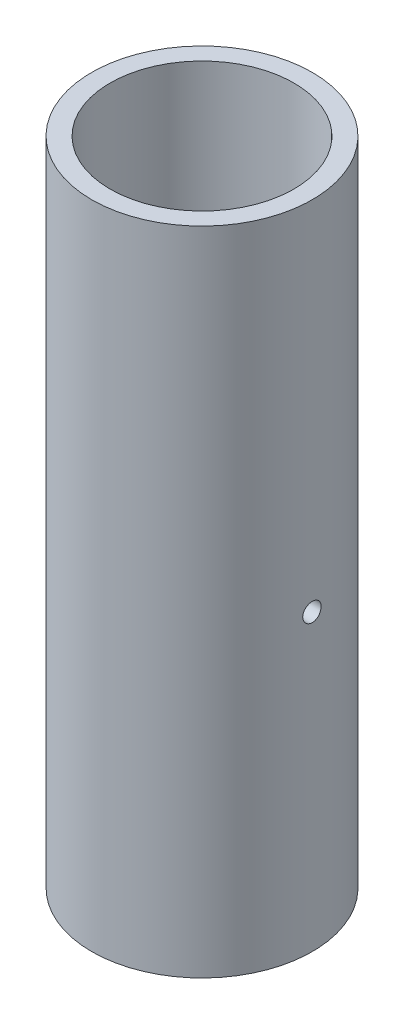
ISO-10303-21;
HEADER;
FILE_DESCRIPTION(('STEP AP214'),'2;1');
FILE_NAME('part.step','',(''),(''),'','','');
FILE_SCHEMA(('AUTOMOTIVE_DESIGN { 1 0 10303 214 1 1 1 1 }'));
ENDSEC;
DATA;
#1=APPLICATION_CONTEXT('core data for automotive mechanical design processes');
#2=APPLICATION_PROTOCOL_DEFINITION('international standard','automotive_design',2000,#1);
#3=PRODUCT_CONTEXT('',#1,'mechanical');
#4=PRODUCT('Part','Part','',(#3));
#5=PRODUCT_RELATED_PRODUCT_CATEGORY('part','',(#4));
#6=PRODUCT_DEFINITION_FORMATION('','',#4);
#7=PRODUCT_DEFINITION_CONTEXT('part definition',#1,'design');
#8=PRODUCT_DEFINITION('design','',#6,#7);
#9=PRODUCT_DEFINITION_SHAPE('','',#8);
#10=(LENGTH_UNIT() NAMED_UNIT(*) SI_UNIT(.MILLI.,.METRE.));
#11=(NAMED_UNIT(*) PLANE_ANGLE_UNIT() SI_UNIT($,.RADIAN.));
#12=(NAMED_UNIT(*) SI_UNIT($,.STERADIAN.) SOLID_ANGLE_UNIT());
#13=UNCERTAINTY_MEASURE_WITH_UNIT(LENGTH_MEASURE(1.E-05),#10,'distance_accuracy_value','');
#14=(GEOMETRIC_REPRESENTATION_CONTEXT(3) GLOBAL_UNCERTAINTY_ASSIGNED_CONTEXT((#13)) GLOBAL_UNIT_ASSIGNED_CONTEXT((#10,
#11,#12)) REPRESENTATION_CONTEXT('',''));
#15=CARTESIAN_POINT('',(0.,0.,0.));
#16=DIRECTION('',(0.,0.,1.));
#17=DIRECTION('',(1.,0.,0.));
#18=AXIS2_PLACEMENT_3D('',#15,#16,#17);
#19=CARTESIAN_POINT('',(0.,56.229999986,0.));
#20=DIRECTION('',(0.,1.,0.));
#21=DIRECTION('',(0.,0.,1.));
#22=AXIS2_PLACEMENT_3D('',#19,#20,#21);
#23=PLANE('',#22);
#24=CARTESIAN_POINT('',(0.,56.229999986,0.));
#25=DIRECTION('',(0.,1.,0.));
#26=DIRECTION('',(0.,0.,1.));
#27=AXIS2_PLACEMENT_3D('',#24,#25,#26);
#28=CIRCLE('',#27,9.525);
#29=CARTESIAN_POINT('',(0.,56.229999986,9.525));
#30=VERTEX_POINT('',#29);
#31=EDGE_CURVE('E10',#30,#30,#28,.T.);
#32=ORIENTED_EDGE('',*,*,#31,.T.);
#33=EDGE_LOOP('',(#32));
#34=FACE_BOUND('',#33,.T.);
#35=CARTESIAN_POINT('',(0.,56.229999986,0.));
#36=DIRECTION('',(0.,1.,0.));
#37=DIRECTION('',(0.,0.,1.));
#38=AXIS2_PLACEMENT_3D('',#35,#36,#37);
#39=CIRCLE('',#38,7.9375);
#40=CARTESIAN_POINT('',(0.,56.229999986,7.9375));
#41=VERTEX_POINT('',#40);
#42=EDGE_CURVE('E43',#41,#41,#39,.T.);
#43=ORIENTED_EDGE('',*,*,#42,.F.);
#44=EDGE_LOOP('',(#43));
#45=FACE_BOUND('',#44,.T.);
#46=ADVANCED_FACE('F32',(#34,#45),#23,.T.);
#47=CARTESIAN_POINT('',(0.,0.,0.));
#48=DIRECTION('',(0.,1.,0.));
#49=DIRECTION('',(0.,0.,1.));
#50=AXIS2_PLACEMENT_3D('',#47,#48,#49);
#51=PLANE('',#50);
#52=CARTESIAN_POINT('',(0.,0.,0.));
#53=DIRECTION('',(0.,1.,0.));
#54=DIRECTION('',(0.,0.,1.));
#55=AXIS2_PLACEMENT_3D('',#52,#53,#54);
#56=CIRCLE('',#55,9.525);
#57=CARTESIAN_POINT('',(0.,0.,9.525));
#58=VERTEX_POINT('',#57);
#59=EDGE_CURVE('E36',#58,#58,#56,.T.);
#60=ORIENTED_EDGE('',*,*,#59,.F.);
#61=EDGE_LOOP('',(#60));
#62=FACE_BOUND('',#61,.T.);
#63=CARTESIAN_POINT('',(0.,0.,0.));
#64=DIRECTION('',(0.,1.,0.));
#65=DIRECTION('',(0.,0.,1.));
#66=AXIS2_PLACEMENT_3D('',#63,#64,#65);
#67=CIRCLE('',#66,7.9375);
#68=CARTESIAN_POINT('',(0.,0.,7.9375));
#69=VERTEX_POINT('',#68);
#70=EDGE_CURVE('E45',#69,#69,#67,.T.);
#71=ORIENTED_EDGE('',*,*,#70,.T.);
#72=EDGE_LOOP('',(#71));
#73=FACE_BOUND('',#72,.T.);
#74=ADVANCED_FACE('F76',(#62,#73),#51,.F.);
#75=CARTESIAN_POINT('',(0.,56.229999986,0.));
#76=DIRECTION('',(0.,-1.,0.));
#77=DIRECTION('',(0.,0.,-1.));
#78=AXIS2_PLACEMENT_3D('',#75,#76,#77);
#79=CYLINDRICAL_SURFACE('',#78,9.525);
#80=CARTESIAN_POINT('',(9.49186946483673,25.4,0.793749999999992));
#81=CARTESIAN_POINT('',(9.49186990376636,25.4445021563524,0.793748055971606));
#82=CARTESIAN_POINT('',(9.49218580336204,25.4890346090127,0.789994841743101));
#83=CARTESIAN_POINT('',(9.4934152567598,25.5768673598976,0.775077808390209));
#84=CARTESIAN_POINT('',(9.49432948773761,25.620166203945,0.763905592424556));
#85=CARTESIAN_POINT('',(9.49665134174957,25.7042469119245,0.734475912885405));
#86=CARTESIAN_POINT('',(9.49805868502322,25.745030187633,0.716222466123069));
#87=CARTESIAN_POINT('',(9.50120784144409,25.8229442861979,0.673155616860326));
#88=CARTESIAN_POINT('',(9.50294958306382,25.8600758875799,0.648343616801319));
#89=CARTESIAN_POINT('',(9.50657630668715,25.9297376399341,0.592795150813561));
#90=CARTESIAN_POINT('',(9.50846160572916,25.9622571240412,0.562045327362736));
#91=CARTESIAN_POINT('',(9.51216011434801,26.0216798957014,0.495522345786646));
#92=CARTESIAN_POINT('',(9.51397332077246,26.0485829378833,0.459748968306353));
#93=CARTESIAN_POINT('',(9.51732634652841,26.0960446253833,0.384130744713849));
#94=CARTESIAN_POINT('',(9.51886576680833,26.1165940417753,0.344280086874898));
#95=CARTESIAN_POINT('',(9.52149435369253,26.1507061210753,0.261679055395891));
#96=CARTESIAN_POINT('',(9.52258352817769,26.1642689062748,0.218928732525327));
#97=CARTESIAN_POINT('',(9.52418668765556,26.1839920215607,0.131848063033574));
#98=CARTESIAN_POINT('',(9.52470201339087,26.1901696089511,0.087521650134405));
#99=CARTESIAN_POINT('',(9.52510395532792,26.1950003175278,-0.00154168625004364));
#100=CARTESIAN_POINT('',(9.52499058322115,26.1936535786392,-0.0462786020860159));
#101=CARTESIAN_POINT('',(9.52414900982039,26.1834879775826,-0.134776012768057));
#102=CARTESIAN_POINT('',(9.52342233553507,26.1746876732179,-0.178538655870017));
#103=CARTESIAN_POINT('',(9.52143764884604,26.1498936051738,-0.263963519919441));
#104=CARTESIAN_POINT('',(9.52017963138687,26.1338997730515,-0.305625720878002));
#105=CARTESIAN_POINT('',(9.51727116030383,26.0951519727246,-0.385726115005501));
#106=CARTESIAN_POINT('',(9.51562022470132,26.0723896932872,-0.424160269485556));
#107=CARTESIAN_POINT('',(9.51211144682469,26.020757170997,-0.496669485352657));
#108=CARTESIAN_POINT('',(9.51025360035402,25.9918868042498,-0.530744458297079));
#109=CARTESIAN_POINT('',(9.50653312643144,25.9287530382855,-0.593676553295625));
#110=CARTESIAN_POINT('',(9.50467050161177,25.8944735135126,-0.622517500727859));
#111=CARTESIAN_POINT('',(9.50115608156825,25.8215506990639,-0.674037894144891));
#112=CARTESIAN_POINT('',(9.4995042865182,25.782907405791,-0.696717335050532));
#113=CARTESIAN_POINT('',(9.49659824464482,25.7023426390811,-0.735270313645887));
#114=CARTESIAN_POINT('',(9.49534404686078,25.6604207620609,-0.751143011883162));
#115=CARTESIAN_POINT('',(9.49337615290985,25.574494255047,-0.775619961828872));
#116=CARTESIAN_POINT('',(9.49266244537978,25.5304896688606,-0.784224366345242));
#117=CARTESIAN_POINT('',(9.49185818236624,25.4417884081717,-0.793900005186882));
#118=CARTESIAN_POINT('',(9.49176576106665,25.3970942102765,-0.794993795231065));
#119=CARTESIAN_POINT('',(9.49220960975968,25.3081580897281,-0.78967624087932));
#120=CARTESIAN_POINT('',(9.49274587388829,25.2639161628603,-0.783264966486057));
#121=CARTESIAN_POINT('',(9.49438496839893,25.1772052050841,-0.763138079736212));
#122=CARTESIAN_POINT('',(9.49548698222649,25.1347337141418,-0.74943299359787));
#123=CARTESIAN_POINT('',(9.49813272915068,25.0526930347825,-0.71511822164493));
#124=CARTESIAN_POINT('',(9.49967646933491,25.0131238929473,-0.69450842504173));
#125=CARTESIAN_POINT('',(9.50303625061403,24.937907918551,-0.646912193583286));
#126=CARTESIAN_POINT('',(9.50485292981518,24.9022706262088,-0.619910728112494));
#127=CARTESIAN_POINT('',(9.50855173607938,24.8360263844052,-0.560319339429805));
#128=CARTESIAN_POINT('',(9.51043386426818,24.8054195215212,-0.5277293200546));
#129=CARTESIAN_POINT('',(9.51405705380132,24.75002796542,-0.457788464748691));
#130=CARTESIAN_POINT('',(9.51579775302222,24.7252579273038,-0.420426000975298));
#131=CARTESIAN_POINT('',(9.51893673322652,24.6823437061081,-0.342058778363931));
#132=CARTESIAN_POINT('',(9.52033501763161,24.6641994568175,-0.301054055928032));
#133=CARTESIAN_POINT('',(9.52262995155359,24.6350770295822,-0.216618803146334));
#134=CARTESIAN_POINT('',(9.52352723525412,24.624089789103,-0.17319141647573));
#135=CARTESIAN_POINT('',(9.52472164243053,24.6095636476827,-0.085100460883874));
#136=CARTESIAN_POINT('',(9.52501877726648,24.6060246057566,-0.0404369153777758));
#137=CARTESIAN_POINT('',(9.52497942499495,24.6064969670583,0.048714063414247));
#138=CARTESIAN_POINT('',(9.52464485453844,24.6104855308343,0.0932016203427867));
#139=CARTESIAN_POINT('',(9.52338347570212,24.6258522551435,0.180872695198681));
#140=CARTESIAN_POINT('',(9.52245666651792,24.6372304257134,0.22405621135477));
#141=CARTESIAN_POINT('',(9.52011479977499,24.6670475750346,0.307894868118692));
#142=CARTESIAN_POINT('',(9.51869977058731,24.6854861435046,0.348550155482951));
#143=CARTESIAN_POINT('',(9.51553976968878,24.7288980635344,0.426191817238593));
#144=CARTESIAN_POINT('',(9.51379480319573,24.7538713117539,0.463178249637052));
#145=CARTESIAN_POINT('',(9.51016448310669,24.8097294117865,0.532549170981452));
#146=CARTESIAN_POINT('',(9.50827873782952,24.8406311633063,0.564920031562782));
#147=CARTESIAN_POINT('',(9.50458272578044,24.9074385714262,0.624028649831631));
#148=CARTESIAN_POINT('',(9.50277247739882,24.9433454380783,0.650765041374525));
#149=CARTESIAN_POINT('',(9.49942874374388,25.0192135193064,0.697881969564458));
#150=CARTESIAN_POINT('',(9.49789578341389,25.0591822046885,0.71825050299515));
#151=CARTESIAN_POINT('',(9.49528660061675,25.1419577779081,0.751961365116193));
#152=CARTESIAN_POINT('',(9.49420985331826,25.1847613385437,0.765311771800257));
#153=CARTESIAN_POINT('',(9.49291192749276,25.2565145143553,0.781207240292323));
#154=CARTESIAN_POINT('',(9.49252280108811,25.285002653143,0.785904522658876));
#155=CARTESIAN_POINT('',(9.49200142785512,25.34232295252,0.792176528345903));
#156=CARTESIAN_POINT('',(9.49186918033645,25.3711551121847,0.793751260057601));
#157=CARTESIAN_POINT('',(9.49186946483673,25.4,0.793749999999992));
#158=B_SPLINE_CURVE_WITH_KNOTS('',3,(#80,#81,#82,#83,#84,#85,#86,#87,#88,#89,#90,#91,#92,#93,
#94,#95,#96,#97,#98,#99,#100,#101,#102,#103,#104,#105,#106,#107,#108,#109,#110,#111,#112,#113,
#114,#115,#116,#117,#118,#119,#120,#121,#122,#123,#124,#125,#126,#127,#128,#129,#130,#131,#132,
#133,#134,#135,#136,#137,#138,#139,#140,#141,#142,#143,#144,#145,#146,#147,#148,#149,#150,#151,
#152,#153,#154,#155,#156,#157),.UNSPECIFIED.,.T.,.F.,(4,2,2,2,2,2,2,2,2,2,2,2,2,2,2,2,2,2,2,2,2,
2,2,2,2,2,2,2,2,2,2,2,2,2,2,2,2,2,4),(0.,0.133401150877658,0.266953543369253,0.400430289099391,
0.533878516025929,0.667630516314067,0.801388358741378,0.935339587442488,1.06928847143097,
1.20292373573729,1.33655651492219,1.46985755148966,1.60315985638004,1.73662652897046,
1.87009590901207,2.003970973181,2.13784614770771,2.27173782785985,2.40562669301563,
2.53911328941236,2.67259864073742,2.80589187018531,2.93918723847417,3.07279923319132,
3.20641352722616,3.34035980816228,3.47430475054045,3.60807975424293,3.74185222572932,
3.87521947155303,4.00858689852006,4.14194657665054,4.27530414593819,4.40904766781927,
4.54282358020791,4.67685015652602,4.81072212611857,4.89718875801903,4.98365515755757),.UNSPECIFIED.);
#159=CARTESIAN_POINT('',(9.49186946483673,25.4,0.793749999999992));
#160=VERTEX_POINT('',#159);
#161=EDGE_CURVE('E57',#160,#160,#158,.T.);
#162=ORIENTED_EDGE('',*,*,#161,.T.);
#163=EDGE_LOOP('',(#162));
#164=FACE_BOUND('',#163,.T.);
#165=ORIENTED_EDGE('',*,*,#31,.F.);
#166=EDGE_LOOP('',(#165));
#167=FACE_BOUND('',#166,.T.);
#168=ORIENTED_EDGE('',*,*,#59,.T.);
#169=EDGE_LOOP('',(#168));
#170=FACE_BOUND('',#169,.T.);
#171=ADVANCED_FACE('F34',(#164,#167,#170),#79,.T.);
#172=CARTESIAN_POINT('',(0.,56.229999986,0.));
#173=DIRECTION('',(0.,-1.,0.));
#174=DIRECTION('',(0.,0.,-1.));
#175=AXIS2_PLACEMENT_3D('',#172,#173,#174);
#176=CYLINDRICAL_SURFACE('',#175,7.9375);
#177=CARTESIAN_POINT('',(7.8977127820338,25.4,0.793749999999992));
#178=CARTESIAN_POINT('',(7.89771330345042,25.4444655290628,0.793748073881092));
#179=CARTESIAN_POINT('',(7.89809235239161,25.4889604586769,0.790001006817332));
#180=CARTESIAN_POINT('',(7.89956738249257,25.5767166791205,0.77510982484357));
#181=CARTESIAN_POINT('',(7.90066415372343,25.6199765555673,0.763957558066101));
#182=CARTESIAN_POINT('',(7.90344918106364,25.7039791190042,0.734583967129704));
#183=CARTESIAN_POINT('',(7.90513707852764,25.7447233147044,0.716366928558276));
#184=CARTESIAN_POINT('',(7.90891373328882,25.8225669351316,0.673389137241682));
#185=CARTESIAN_POINT('',(7.91100241094811,25.8596670817464,0.648629684153074));
#186=CARTESIAN_POINT('',(7.91535379325982,25.9293131905281,0.593173154836468));
#187=CARTESIAN_POINT('',(7.9176170387918,25.9618440387936,0.562457138123428));
#188=CARTESIAN_POINT('',(7.92205763530852,26.0212979771466,0.495999861534902));
#189=CARTESIAN_POINT('',(7.9242349823595,26.0482208106537,0.460258371857087));
#190=CARTESIAN_POINT('',(7.92826379129761,26.0957466852494,0.38467217456047));
#191=CARTESIAN_POINT('',(7.93011456022626,26.1163363552925,0.344819019632844));
#192=CARTESIAN_POINT('',(7.93327579645143,26.1505258938118,0.26219942502821));
#193=CARTESIAN_POINT('',(7.93458627691794,26.1641259326683,0.219433056392898));
#194=CARTESIAN_POINT('',(7.93651548465752,26.1839058405491,0.132353671302216));
#195=CARTESIAN_POINT('',(7.93713652475236,26.1901105234953,0.0880463433313186));
#196=CARTESIAN_POINT('',(7.93762474256462,26.1950003698749,-0.000984837921846691));
#197=CARTESIAN_POINT('',(7.9374919398281,26.1936857282736,-0.0457086803744761));
#198=CARTESIAN_POINT('',(7.93648932853254,26.1835943873339,-0.134134894976241));
#199=CARTESIAN_POINT('',(7.93562215539172,26.1748443707712,-0.177840346260886));
#200=CARTESIAN_POINT('',(7.93325128854038,26.1501722288986,-0.263159223731718));
#201=CARTESIAN_POINT('',(7.93174758656163,26.1342500104249,-0.304772622735192));
#202=CARTESIAN_POINT('',(7.92826819127858,26.0956561816668,-0.384810249776916));
#203=CARTESIAN_POINT('',(7.9262916734657,26.0729727638354,-0.423228746966679));
#204=CARTESIAN_POINT('',(7.92208842712279,26.0215090096018,-0.49572347608201));
#205=CARTESIAN_POINT('',(7.91986169125531,25.9927284943848,-0.52979958060765));
#206=CARTESIAN_POINT('',(7.91539639190107,25.9297374553235,-0.592798512634252));
#207=CARTESIAN_POINT('',(7.91315781929841,25.8955037201114,-0.621698136038577));
#208=CARTESIAN_POINT('',(7.90893087318026,25.8226584882389,-0.673344106190339));
#209=CARTESIAN_POINT('',(7.90694250002772,25.7840469852286,-0.696090444012099));
#210=CARTESIAN_POINT('',(7.90344089801856,25.7035244237477,-0.734784046504994));
#211=CARTESIAN_POINT('',(7.90192776936465,25.6616126717643,-0.750729877579779));
#212=CARTESIAN_POINT('',(7.89955003360057,25.5756881450871,-0.775351458912329));
#213=CARTESIAN_POINT('',(7.89868540673279,25.5316754344456,-0.784027430658525));
#214=CARTESIAN_POINT('',(7.89770598293637,25.4430020574985,-0.79383316546736));
#215=CARTESIAN_POINT('',(7.8975879604091,25.3983450151648,-0.794995391088716));
#216=CARTESIAN_POINT('',(7.8981065951285,25.3094718077531,-0.789825895954136));
#217=CARTESIAN_POINT('',(7.89874324217792,25.2652556367261,-0.783494276456485));
#218=CARTESIAN_POINT('',(7.90069654635281,25.1786139315666,-0.763543982265336));
#219=CARTESIAN_POINT('',(7.90201177088568,25.1361848279436,-0.749940657206188));
#220=CARTESIAN_POINT('',(7.90517287262043,25.0542107089391,-0.71584877124277));
#221=CARTESIAN_POINT('',(7.90701876197757,25.0146657596471,-0.695360052621967));
#222=CARTESIAN_POINT('',(7.91104101332348,24.9394345206147,-0.647997657379674));
#223=CARTESIAN_POINT('',(7.91321847959146,24.9037618335643,-0.621102469248544));
#224=CARTESIAN_POINT('',(7.91765492146241,24.8374256764637,-0.561721423426866));
#225=CARTESIAN_POINT('',(7.9199138990825,24.8067623304801,-0.529235427309455));
#226=CARTESIAN_POINT('',(7.92426856730383,24.7512033284903,-0.459454094604762));
#227=CARTESIAN_POINT('',(7.92636364031533,24.7263288495784,-0.422141853175751));
#228=CARTESIAN_POINT('',(7.93014544672138,24.683199404373,-0.343850688199846));
#229=CARTESIAN_POINT('',(7.93183218571091,24.6649443473787,-0.302871814903514));
#230=CARTESIAN_POINT('',(7.93460448266117,24.6356078219236,-0.218484550356046));
#231=CARTESIAN_POINT('',(7.93569111205734,24.6245135625606,-0.175080642384656));
#232=CARTESIAN_POINT('',(7.93714515099584,24.609771813521,-0.0870146960995471));
#233=CARTESIAN_POINT('',(7.93751258075146,24.6061241145567,-0.0423526931806997));
#234=CARTESIAN_POINT('',(7.93748681036157,24.6063819739867,0.0467536403601214));
#235=CARTESIAN_POINT('',(7.93709692086481,24.6102546567391,0.0911980707344663));
#236=CARTESIAN_POINT('',(7.93560685527213,24.6253744106152,0.178801623882859));
#237=CARTESIAN_POINT('',(7.93450667861868,24.6366214875273,0.221960745648011));
#238=CARTESIAN_POINT('',(7.93171930777332,24.6661616605556,0.305768302584391));
#239=CARTESIAN_POINT('',(7.93003219365079,24.684453795629,0.346417079324032));
#240=CARTESIAN_POINT('',(7.92625901105435,24.7275613278279,0.424072526372862));
#241=CARTESIAN_POINT('',(7.92417294491485,24.752376686784,0.461079217991287));
#242=CARTESIAN_POINT('',(7.91982465331062,24.8079495101001,0.530568475013876));
#243=CARTESIAN_POINT('',(7.9175617259693,24.8387314503943,0.563031422686595));
#244=CARTESIAN_POINT('',(7.91312068923417,24.9053154352892,0.622345846518299));
#245=CARTESIAN_POINT('',(7.91094260032548,24.941118682853,0.649195974154221));
#246=CARTESIAN_POINT('',(7.90691191832164,25.0168285713989,0.696576458336584));
#247=CARTESIAN_POINT('',(7.90506016715712,25.056745417051,0.717090567970893));
#248=CARTESIAN_POINT('',(7.90190185842704,25.1394502061767,0.75109761205339));
#249=CARTESIAN_POINT('',(7.90059468624854,25.182234849366,0.764598465950066));
#250=CARTESIAN_POINT('',(7.89900318483403,25.2543847693387,0.780829090114731));
#251=CARTESIAN_POINT('',(7.89852157223957,25.2832887869745,0.785667809216083));
#252=CARTESIAN_POINT('',(7.8978761998477,25.34145762204,0.792128891517801));
#253=CARTESIAN_POINT('',(7.897712438716,25.3707224379547,0.79375126821982));
#254=CARTESIAN_POINT('',(7.8977127820338,25.4,0.793749999999992));
#255=B_SPLINE_CURVE_WITH_KNOTS('',3,(#177,#178,#179,#180,#181,#182,#183,#184,#185,#186,#187,
#188,#189,#190,#191,#192,#193,#194,#195,#196,#197,#198,#199,#200,#201,#202,#203,#204,#205,#206,
#207,#208,#209,#210,#211,#212,#213,#214,#215,#216,#217,#218,#219,#220,#221,#222,#223,#224,#225,
#226,#227,#228,#229,#230,#231,#232,#233,#234,#235,#236,#237,#238,#239,#240,#241,#242,#243,#244,
#245,#246,#247,#248,#249,#250,#251,#252,#253,#254),.UNSPECIFIED.,.T.,.F.,(4,2,2,2,2,2,2,2,2,2,2,
2,2,2,2,2,2,2,2,2,2,2,2,2,2,2,2,2,2,2,2,2,2,2,2,2,2,2,4),(0.,0.133289670583936,
0.266726314258526,0.400082139729237,0.533411493834408,0.66717196964377,0.800938563976058,
0.934985667897117,1.06902950411186,1.20262230025643,1.33621163254845,1.46932357756061,
1.60243725169272,1.73578476713964,1.86913619392205,2.00307118661218,2.13700637358126,
2.27096978112357,2.40492910709805,2.53830928319286,2.67168765704951,2.80478559171715,
2.93788657532828,3.07144094413048,3.20499862017789,3.33903746099378,3.47307446511163,
3.60687137951146,3.74066453346058,3.87387412190605,4.00708381491093,4.14027534271222,
4.27346609118567,4.40721523811399,4.5409964824615,4.67511797599686,4.80908768697108,
4.89685034412295,4.98461263286149),.UNSPECIFIED.);
#256=CARTESIAN_POINT('',(7.8977127820338,25.4,0.793749999999992));
#257=VERTEX_POINT('',#256);
#258=EDGE_CURVE('E48',#257,#257,#255,.T.);
#259=ORIENTED_EDGE('',*,*,#258,.F.);
#260=EDGE_LOOP('',(#259));
#261=FACE_BOUND('',#260,.T.);
#262=ORIENTED_EDGE('',*,*,#42,.T.);
#263=EDGE_LOOP('',(#262));
#264=FACE_BOUND('',#263,.T.);
#265=ORIENTED_EDGE('',*,*,#70,.F.);
#266=EDGE_LOOP('',(#265));
#267=FACE_BOUND('',#266,.T.);
#268=ADVANCED_FACE('F61',(#261,#264,#267),#176,.F.);
#269=CARTESIAN_POINT('',(0.,25.4,0.));
#270=DIRECTION('',(-1.,0.,0.));
#271=DIRECTION('',(0.,0.,1.));
#272=AXIS2_PLACEMENT_3D('',#269,#270,#271);
#273=CYLINDRICAL_SURFACE('',#272,0.793749999999992);
#274=ORIENTED_EDGE('',*,*,#258,.T.);
#275=EDGE_LOOP('',(#274));
#276=FACE_BOUND('',#275,.T.);
#277=ORIENTED_EDGE('',*,*,#161,.F.);
#278=EDGE_LOOP('',(#277));
#279=FACE_BOUND('',#278,.T.);
#280=ADVANCED_FACE('F64',(#276,#279),#273,.F.);
#281=CLOSED_SHELL('',(#46,#74,#171,#268,#280));
#282=MANIFOLD_SOLID_BREP('B2',#281);
#283=ADVANCED_BREP_SHAPE_REPRESENTATION('',(#18,#282),#14);
#284=SHAPE_DEFINITION_REPRESENTATION(#9,#283);
ENDSEC;
END-ISO-10303-21;
